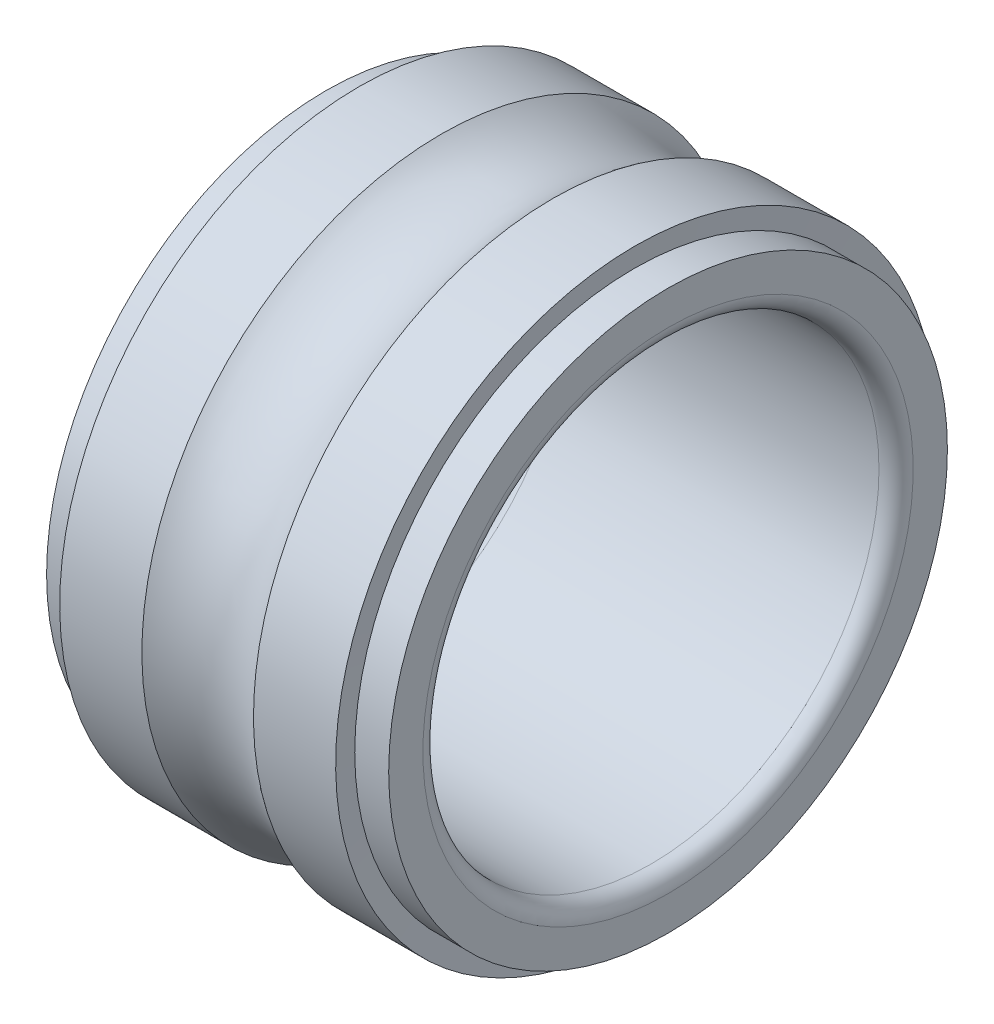
ISO-10303-21;
HEADER;
FILE_DESCRIPTION(('STEP AP214'),'2;1');
FILE_NAME('part.step','',(''),(''),'','','');
FILE_SCHEMA(('AUTOMOTIVE_DESIGN { 1 0 10303 214 1 1 1 1 }'));
ENDSEC;
DATA;
#1=APPLICATION_CONTEXT('core data for automotive mechanical design processes');
#2=APPLICATION_PROTOCOL_DEFINITION('international standard','automotive_design',2000,#1);
#3=PRODUCT_CONTEXT('',#1,'mechanical');
#4=PRODUCT('Part','Part','',(#3));
#5=PRODUCT_RELATED_PRODUCT_CATEGORY('part','',(#4));
#6=PRODUCT_DEFINITION_FORMATION('','',#4);
#7=PRODUCT_DEFINITION_CONTEXT('part definition',#1,'design');
#8=PRODUCT_DEFINITION('design','',#6,#7);
#9=PRODUCT_DEFINITION_SHAPE('','',#8);
#10=(LENGTH_UNIT() NAMED_UNIT(*) SI_UNIT(.MILLI.,.METRE.));
#11=(NAMED_UNIT(*) PLANE_ANGLE_UNIT() SI_UNIT($,.RADIAN.));
#12=(NAMED_UNIT(*) SI_UNIT($,.STERADIAN.) SOLID_ANGLE_UNIT());
#13=UNCERTAINTY_MEASURE_WITH_UNIT(LENGTH_MEASURE(1.E-05),#10,'distance_accuracy_value','');
#14=(GEOMETRIC_REPRESENTATION_CONTEXT(3) GLOBAL_UNCERTAINTY_ASSIGNED_CONTEXT((#13)) GLOBAL_UNIT_ASSIGNED_CONTEXT((#10,
#11,#12)) REPRESENTATION_CONTEXT('',''));
#15=CARTESIAN_POINT('',(0.,0.,0.));
#16=DIRECTION('',(0.,0.,1.));
#17=DIRECTION('',(1.,0.,0.));
#18=AXIS2_PLACEMENT_3D('',#15,#16,#17);
#19=CARTESIAN_POINT('',(0.58764066500899,0.,0.));
#20=DIRECTION('',(-1.,0.,0.));
#21=DIRECTION('',(0.,1.,0.));
#22=AXIS2_PLACEMENT_3D('',#19,#20,#21);
#23=CONICAL_SURFACE('',#22,5.075,1.52716309549504);
#24=CARTESIAN_POINT('',(0.595281330017979,0.,0.));
#25=DIRECTION('',(1.,0.,0.));
#26=DIRECTION('',(0.,1.,0.));
#27=AXIS2_PLACEMENT_3D('',#24,#25,#26);
#28=CIRCLE('',#27,4.9);
#29=CARTESIAN_POINT('',(0.595281330017979,4.9,0.));
#30=VERTEX_POINT('',#29);
#31=EDGE_CURVE('E11',#30,#30,#28,.T.);
#32=ORIENTED_EDGE('',*,*,#31,.T.);
#33=EDGE_LOOP('',(#32));
#34=FACE_BOUND('',#33,.T.);
#35=CARTESIAN_POINT('',(0.58,0.,0.));
#36=DIRECTION('',(1.,0.,0.));
#37=DIRECTION('',(0.,1.,0.));
#38=AXIS2_PLACEMENT_3D('',#35,#36,#37);
#39=CIRCLE('',#38,5.25);
#40=CARTESIAN_POINT('',(0.58,5.25,0.));
#41=VERTEX_POINT('',#40);
#42=EDGE_CURVE('E72',#41,#41,#39,.T.);
#43=ORIENTED_EDGE('',*,*,#42,.F.);
#44=EDGE_LOOP('',(#43));
#45=FACE_BOUND('',#44,.T.);
#46=ADVANCED_FACE('F16',(#34,#45),#23,.F.);
#47=CARTESIAN_POINT('',(0.29764066500899,0.,0.));
#48=DIRECTION('',(-1.,0.,0.));
#49=DIRECTION('',(0.,1.,0.));
#50=AXIS2_PLACEMENT_3D('',#47,#48,#49);
#51=CYLINDRICAL_SURFACE('',#50,4.9);
#52=CARTESIAN_POINT('',(0.,0.,0.));
#53=DIRECTION('',(1.,0.,0.));
#54=DIRECTION('',(0.,1.,0.));
#55=AXIS2_PLACEMENT_3D('',#52,#53,#54);
#56=CIRCLE('',#55,4.9);
#57=CARTESIAN_POINT('',(0.,4.9,0.));
#58=VERTEX_POINT('',#57);
#59=EDGE_CURVE('E26',#58,#58,#56,.T.);
#60=ORIENTED_EDGE('',*,*,#59,.T.);
#61=EDGE_LOOP('',(#60));
#62=FACE_BOUND('',#61,.T.);
#63=ORIENTED_EDGE('',*,*,#31,.F.);
#64=EDGE_LOOP('',(#63));
#65=FACE_BOUND('',#64,.T.);
#66=ADVANCED_FACE('F90',(#62,#65),#51,.T.);
#67=CARTESIAN_POINT('',(0.,4.6,0.));
#68=DIRECTION('',(-1.,0.,0.));
#69=DIRECTION('',(0.,-1.,0.));
#70=AXIS2_PLACEMENT_3D('',#67,#68,#69);
#71=PLANE('',#70);
#72=CARTESIAN_POINT('',(0.,0.,0.));
#73=DIRECTION('',(1.,0.,0.));
#74=DIRECTION('',(0.,1.,0.));
#75=AXIS2_PLACEMENT_3D('',#72,#73,#74);
#76=CIRCLE('',#75,4.3);
#77=CARTESIAN_POINT('',(0.,4.3,0.));
#78=VERTEX_POINT('',#77);
#79=EDGE_CURVE('E75',#78,#78,#76,.T.);
#80=ORIENTED_EDGE('',*,*,#79,.T.);
#81=EDGE_LOOP('',(#80));
#82=FACE_BOUND('',#81,.T.);
#83=ORIENTED_EDGE('',*,*,#59,.F.);
#84=EDGE_LOOP('',(#83));
#85=FACE_BOUND('',#84,.T.);
#86=ADVANCED_FACE('F18',(#82,#85),#71,.T.);
#87=CARTESIAN_POINT('',(0.3,0.,0.));
#88=DIRECTION('',(1.,0.,0.));
#89=DIRECTION('',(0.,0.,-1.));
#90=AXIS2_PLACEMENT_3D('',#87,#88,#89);
#91=TOROIDAL_SURFACE('',#90,4.3,0.3);
#92=CARTESIAN_POINT('',(0.3,0.,0.));
#93=DIRECTION('',(1.,0.,0.));
#94=DIRECTION('',(0.,1.,0.));
#95=AXIS2_PLACEMENT_3D('',#92,#93,#94);
#96=CIRCLE('',#95,4.);
#97=CARTESIAN_POINT('',(0.3,4.,0.));
#98=VERTEX_POINT('',#97);
#99=EDGE_CURVE('E65',#98,#98,#96,.T.);
#100=ORIENTED_EDGE('',*,*,#99,.T.);
#101=EDGE_LOOP('',(#100));
#102=FACE_BOUND('',#101,.T.);
#103=ORIENTED_EDGE('',*,*,#79,.F.);
#104=EDGE_LOOP('',(#103));
#105=FACE_BOUND('',#104,.T.);
#106=ADVANCED_FACE('F94',(#102,#105),#91,.T.);
#107=CARTESIAN_POINT('',(3.,0.,0.));
#108=DIRECTION('',(-1.,0.,0.));
#109=DIRECTION('',(0.,1.,0.));
#110=AXIS2_PLACEMENT_3D('',#107,#108,#109);
#111=CYLINDRICAL_SURFACE('',#110,4.);
#112=CARTESIAN_POINT('',(5.7,0.,0.));
#113=DIRECTION('',(1.,0.,0.));
#114=DIRECTION('',(0.,1.,0.));
#115=AXIS2_PLACEMENT_3D('',#112,#113,#114);
#116=CIRCLE('',#115,4.);
#117=CARTESIAN_POINT('',(5.7,4.,0.));
#118=VERTEX_POINT('',#117);
#119=EDGE_CURVE('E53',#118,#118,#116,.T.);
#120=ORIENTED_EDGE('',*,*,#119,.T.);
#121=EDGE_LOOP('',(#120));
#122=FACE_BOUND('',#121,.T.);
#123=ORIENTED_EDGE('',*,*,#99,.F.);
#124=EDGE_LOOP('',(#123));
#125=FACE_BOUND('',#124,.T.);
#126=ADVANCED_FACE('F101',(#122,#125),#111,.F.);
#127=CARTESIAN_POINT('',(5.7,0.,0.));
#128=DIRECTION('',(1.,0.,0.));
#129=DIRECTION('',(0.,0.,-1.));
#130=AXIS2_PLACEMENT_3D('',#127,#128,#129);
#131=TOROIDAL_SURFACE('',#130,4.3,0.3);
#132=CARTESIAN_POINT('',(6.,0.,0.));
#133=DIRECTION('',(1.,0.,0.));
#134=DIRECTION('',(0.,1.,0.));
#135=AXIS2_PLACEMENT_3D('',#132,#133,#134);
#136=CIRCLE('',#135,4.3);
#137=CARTESIAN_POINT('',(6.,4.3,0.));
#138=VERTEX_POINT('',#137);
#139=EDGE_CURVE('E59',#138,#138,#136,.T.);
#140=ORIENTED_EDGE('',*,*,#139,.T.);
#141=EDGE_LOOP('',(#140));
#142=FACE_BOUND('',#141,.T.);
#143=ORIENTED_EDGE('',*,*,#119,.F.);
#144=EDGE_LOOP('',(#143));
#145=FACE_BOUND('',#144,.T.);
#146=ADVANCED_FACE('F60',(#142,#145),#131,.T.);
#147=CARTESIAN_POINT('',(6.,4.6,0.));
#148=DIRECTION('',(1.,0.,0.));
#149=DIRECTION('',(0.,1.,0.));
#150=AXIS2_PLACEMENT_3D('',#147,#148,#149);
#151=PLANE('',#150);
#152=CARTESIAN_POINT('',(6.,0.,0.));
#153=DIRECTION('',(1.,0.,0.));
#154=DIRECTION('',(0.,1.,0.));
#155=AXIS2_PLACEMENT_3D('',#152,#153,#154);
#156=CIRCLE('',#155,4.9);
#157=CARTESIAN_POINT('',(6.,4.9,0.));
#158=VERTEX_POINT('',#157);
#159=EDGE_CURVE('E63',#158,#158,#156,.T.);
#160=ORIENTED_EDGE('',*,*,#159,.T.);
#161=EDGE_LOOP('',(#160));
#162=FACE_BOUND('',#161,.T.);
#163=ORIENTED_EDGE('',*,*,#139,.F.);
#164=EDGE_LOOP('',(#163));
#165=FACE_BOUND('',#164,.T.);
#166=ADVANCED_FACE('F125',(#162,#165),#151,.T.);
#167=CARTESIAN_POINT('',(5.70235933499101,0.,0.));
#168=DIRECTION('',(-1.,0.,0.));
#169=DIRECTION('',(0.,1.,0.));
#170=AXIS2_PLACEMENT_3D('',#167,#168,#169);
#171=CYLINDRICAL_SURFACE('',#170,4.9);
#172=CARTESIAN_POINT('',(5.40471866998202,0.,0.));
#173=DIRECTION('',(1.,0.,0.));
#174=DIRECTION('',(0.,1.,0.));
#175=AXIS2_PLACEMENT_3D('',#172,#173,#174);
#176=CIRCLE('',#175,4.9);
#177=CARTESIAN_POINT('',(5.40471866998202,4.9,0.));
#178=VERTEX_POINT('',#177);
#179=EDGE_CURVE('E67',#178,#178,#176,.T.);
#180=ORIENTED_EDGE('',*,*,#179,.T.);
#181=EDGE_LOOP('',(#180));
#182=FACE_BOUND('',#181,.T.);
#183=ORIENTED_EDGE('',*,*,#159,.F.);
#184=EDGE_LOOP('',(#183));
#185=FACE_BOUND('',#184,.T.);
#186=ADVANCED_FACE('F112',(#182,#185),#171,.T.);
#187=CARTESIAN_POINT('',(5.41235933499101,0.,0.));
#188=DIRECTION('',(1.,0.,0.));
#189=DIRECTION('',(0.,1.,0.));
#190=AXIS2_PLACEMENT_3D('',#187,#188,#189);
#191=CONICAL_SURFACE('',#190,5.075,1.52716309549504);
#192=CARTESIAN_POINT('',(5.42,0.,0.));
#193=DIRECTION('',(1.,0.,0.));
#194=DIRECTION('',(0.,1.,0.));
#195=AXIS2_PLACEMENT_3D('',#192,#193,#194);
#196=CIRCLE('',#195,5.25);
#197=CARTESIAN_POINT('',(5.42,5.25,0.));
#198=VERTEX_POINT('',#197);
#199=EDGE_CURVE('E20',#198,#198,#196,.T.);
#200=ORIENTED_EDGE('',*,*,#199,.T.);
#201=EDGE_LOOP('',(#200));
#202=FACE_BOUND('',#201,.T.);
#203=ORIENTED_EDGE('',*,*,#179,.F.);
#204=EDGE_LOOP('',(#203));
#205=FACE_BOUND('',#204,.T.);
#206=ADVANCED_FACE('F120',(#202,#205),#191,.F.);
#207=CARTESIAN_POINT('',(4.69929956315125,0.,0.));
#208=DIRECTION('',(-1.,0.,0.));
#209=DIRECTION('',(0.,1.,0.));
#210=AXIS2_PLACEMENT_3D('',#207,#208,#209);
#211=CYLINDRICAL_SURFACE('',#210,5.25);
#212=CARTESIAN_POINT('',(3.97859912630249,0.,0.));
#213=DIRECTION('',(1.,0.,0.));
#214=DIRECTION('',(0.,1.,0.));
#215=AXIS2_PLACEMENT_3D('',#212,#213,#214);
#216=CIRCLE('',#215,5.25);
#217=CARTESIAN_POINT('',(3.97859912630249,5.25,0.));
#218=VERTEX_POINT('',#217);
#219=EDGE_CURVE('E71',#218,#218,#216,.T.);
#220=ORIENTED_EDGE('',*,*,#219,.T.);
#221=EDGE_LOOP('',(#220));
#222=FACE_BOUND('',#221,.T.);
#223=ORIENTED_EDGE('',*,*,#199,.F.);
#224=EDGE_LOOP('',(#223));
#225=FACE_BOUND('',#224,.T.);
#226=ADVANCED_FACE('F117',(#222,#225),#211,.T.);
#227=CARTESIAN_POINT('',(3.,0.,0.));
#228=DIRECTION('',(1.,0.,0.));
#229=DIRECTION('',(0.,0.,-1.));
#230=AXIS2_PLACEMENT_3D('',#227,#228,#229);
#231=TOROIDAL_SURFACE('',#230,6.5,1.5875);
#232=CARTESIAN_POINT('',(2.02140087369751,0.,0.));
#233=DIRECTION('',(1.,0.,0.));
#234=DIRECTION('',(0.,1.,0.));
#235=AXIS2_PLACEMENT_3D('',#232,#233,#234);
#236=CIRCLE('',#235,5.25);
#237=CARTESIAN_POINT('',(2.02140087369751,5.25,0.));
#238=VERTEX_POINT('',#237);
#239=EDGE_CURVE('E80',#238,#238,#236,.T.);
#240=ORIENTED_EDGE('',*,*,#239,.T.);
#241=EDGE_LOOP('',(#240));
#242=FACE_BOUND('',#241,.T.);
#243=ORIENTED_EDGE('',*,*,#219,.F.);
#244=EDGE_LOOP('',(#243));
#245=FACE_BOUND('',#244,.T.);
#246=ADVANCED_FACE('F113',(#242,#245),#231,.F.);
#247=CARTESIAN_POINT('',(1.30070043684875,0.,0.));
#248=DIRECTION('',(-1.,0.,0.));
#249=DIRECTION('',(0.,1.,0.));
#250=AXIS2_PLACEMENT_3D('',#247,#248,#249);
#251=CYLINDRICAL_SURFACE('',#250,5.25);
#252=ORIENTED_EDGE('',*,*,#42,.T.);
#253=EDGE_LOOP('',(#252));
#254=FACE_BOUND('',#253,.T.);
#255=ORIENTED_EDGE('',*,*,#239,.F.);
#256=EDGE_LOOP('',(#255));
#257=FACE_BOUND('',#256,.T.);
#258=ADVANCED_FACE('F116',(#254,#257),#251,.T.);
#259=CLOSED_SHELL('',(#46,#66,#86,#106,#126,#146,#166,#186,#206,#226,#246,#258));
#260=MANIFOLD_SOLID_BREP('B1',#259);
#261=ADVANCED_BREP_SHAPE_REPRESENTATION('',(#18,#260),#14);
#262=SHAPE_DEFINITION_REPRESENTATION(#9,#261);
ENDSEC;
END-ISO-10303-21;
